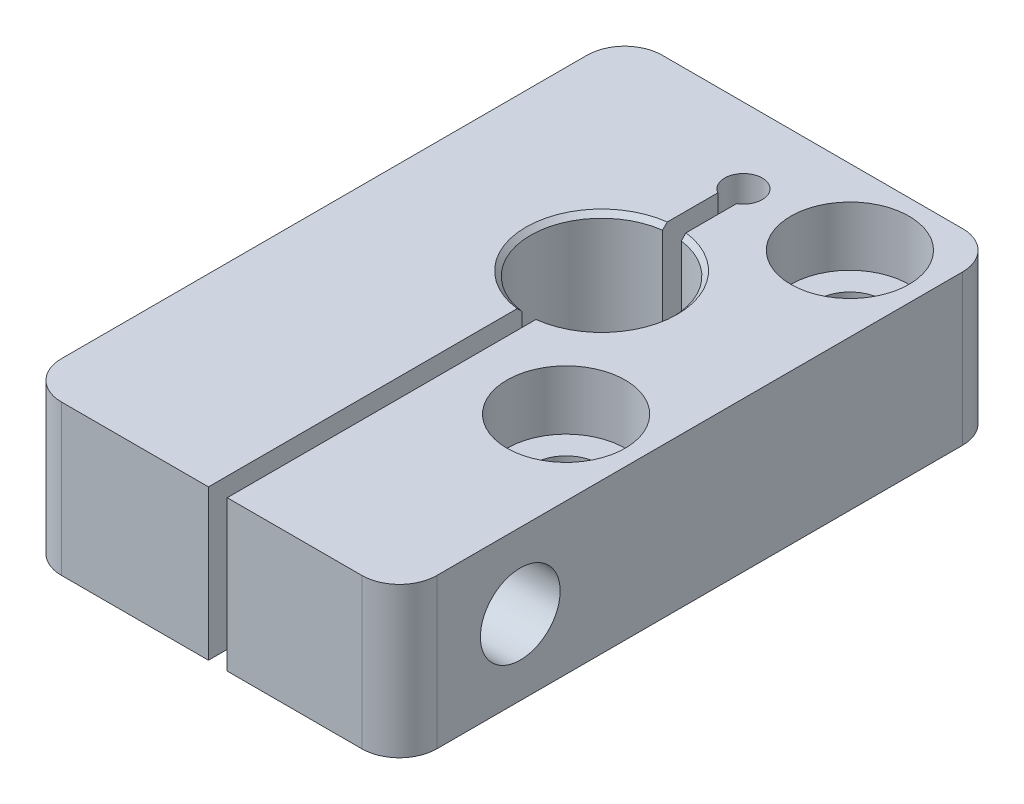
ISO-10303-21;
HEADER;
FILE_DESCRIPTION(('STEP AP214'),'2;1');
FILE_NAME('part.step','',(''),(''),'','','');
FILE_SCHEMA(('AUTOMOTIVE_DESIGN { 1 0 10303 214 1 1 1 1 }'));
ENDSEC;
DATA;
#1=APPLICATION_CONTEXT('core data for automotive mechanical design processes');
#2=APPLICATION_PROTOCOL_DEFINITION('international standard','automotive_design',2000,#1);
#3=PRODUCT_CONTEXT('',#1,'mechanical');
#4=PRODUCT('Part','Part','',(#3));
#5=PRODUCT_RELATED_PRODUCT_CATEGORY('part','',(#4));
#6=PRODUCT_DEFINITION_FORMATION('','',#4);
#7=PRODUCT_DEFINITION_CONTEXT('part definition',#1,'design');
#8=PRODUCT_DEFINITION('design','',#6,#7);
#9=PRODUCT_DEFINITION_SHAPE('','',#8);
#10=(LENGTH_UNIT() NAMED_UNIT(*) SI_UNIT(.MILLI.,.METRE.));
#11=(NAMED_UNIT(*) PLANE_ANGLE_UNIT() SI_UNIT($,.RADIAN.));
#12=(NAMED_UNIT(*) SI_UNIT($,.STERADIAN.) SOLID_ANGLE_UNIT());
#13=UNCERTAINTY_MEASURE_WITH_UNIT(LENGTH_MEASURE(1.E-05),#10,'distance_accuracy_value','');
#14=(GEOMETRIC_REPRESENTATION_CONTEXT(3) GLOBAL_UNCERTAINTY_ASSIGNED_CONTEXT((#13)) GLOBAL_UNIT_ASSIGNED_CONTEXT((#10,
#11,#12)) REPRESENTATION_CONTEXT('',''));
#15=CARTESIAN_POINT('',(0.,0.,0.));
#16=DIRECTION('',(0.,0.,1.));
#17=DIRECTION('',(1.,0.,0.));
#18=AXIS2_PLACEMENT_3D('',#15,#16,#17);
#19=CARTESIAN_POINT('',(15.875,6.35,25.4));
#20=DIRECTION('',(0.,0.,1.));
#21=DIRECTION('',(1.,0.,0.));
#22=AXIS2_PLACEMENT_3D('',#19,#20,#21);
#23=PLANE('',#22);
#24=DIRECTION('',(1.,0.,0.));
#25=VECTOR('',#24,1.);
#26=CARTESIAN_POINT('',(-15.875,-6.35,25.4));
#27=LINE('',#26,#25);
#28=CARTESIAN_POINT('',(1.31875000000001,-6.35,25.4));
#29=VERTEX_POINT('',#28);
#30=CARTESIAN_POINT('',(12.7,-6.35,25.4));
#31=VERTEX_POINT('',#30);
#32=EDGE_CURVE('E257',#29,#31,#27,.T.);
#33=ORIENTED_EDGE('',*,*,#32,.T.);
#34=DIRECTION('',(0.,1.,0.));
#35=VECTOR('',#34,1.);
#36=CARTESIAN_POINT('',(12.7,6.35,25.4));
#37=LINE('',#36,#35);
#38=CARTESIAN_POINT('',(12.7,6.35,25.4));
#39=VERTEX_POINT('',#38);
#40=EDGE_CURVE('E308',#31,#39,#37,.T.);
#41=ORIENTED_EDGE('',*,*,#40,.T.);
#42=DIRECTION('',(-1.,0.,0.));
#43=VECTOR('',#42,1.);
#44=CARTESIAN_POINT('',(-15.875,6.35,25.4));
#45=LINE('',#44,#43);
#46=CARTESIAN_POINT('',(1.31875,6.35,25.4));
#47=VERTEX_POINT('',#46);
#48=EDGE_CURVE('E255',#39,#47,#45,.T.);
#49=ORIENTED_EDGE('',*,*,#48,.T.);
#50=DIRECTION('',(0.,1.,0.));
#51=VECTOR('',#50,1.);
#52=CARTESIAN_POINT('',(1.31875000000001,-6.351,25.4));
#53=LINE('',#52,#51);
#54=EDGE_CURVE('E220',#29,#47,#53,.T.);
#55=ORIENTED_EDGE('',*,*,#54,.F.);
#56=EDGE_LOOP('',(#33,#41,#49,#55));
#57=FACE_BOUND('',#56,.T.);
#58=ADVANCED_FACE('F34',(#57),#23,.T.);
#59=CARTESIAN_POINT('',(-15.875,6.35,25.4));
#60=DIRECTION('',(0.,-1.,0.));
#61=DIRECTION('',(1.,0.,0.));
#62=AXIS2_PLACEMENT_3D('',#59,#60,#61);
#63=PLANE('',#62);
#64=CARTESIAN_POINT('',(9.525,6.35,-19.05));
#65=DIRECTION('',(0.,1.,0.));
#66=DIRECTION('',(0.,0.,1.));
#67=AXIS2_PLACEMENT_3D('',#64,#65,#66);
#68=CIRCLE('',#67,5.);
#69=CARTESIAN_POINT('',(9.525,6.35,-14.05));
#70=VERTEX_POINT('',#69);
#71=EDGE_CURVE('E175',#70,#70,#68,.T.);
#72=ORIENTED_EDGE('',*,*,#71,.F.);
#73=EDGE_LOOP('',(#72));
#74=FACE_BOUND('',#73,.T.);
#75=CARTESIAN_POINT('',(9.525,6.35,4.95));
#76=DIRECTION('',(0.,1.,0.));
#77=DIRECTION('',(0.,0.,1.));
#78=AXIS2_PLACEMENT_3D('',#75,#76,#77);
#79=CIRCLE('',#78,5.);
#80=CARTESIAN_POINT('',(9.525,6.35,9.95));
#81=VERTEX_POINT('',#80);
#82=EDGE_CURVE('E242',#81,#81,#79,.T.);
#83=ORIENTED_EDGE('',*,*,#82,.F.);
#84=EDGE_LOOP('',(#83));
#85=FACE_BOUND('',#84,.T.);
#86=DIRECTION('',(0.,0.,-1.));
#87=VECTOR('',#86,1.);
#88=CARTESIAN_POINT('',(1.31875,6.35,-17.6751846714922));
#89=LINE('',#88,#87);
#90=CARTESIAN_POINT('',(1.31875,6.35,-13.3974381212522));
#91=VERTEX_POINT('',#90);
#92=CARTESIAN_POINT('',(1.31875,6.35,-17.6751846714922));
#93=VERTEX_POINT('',#92);
#94=EDGE_CURVE('E188',#91,#93,#89,.T.);
#95=ORIENTED_EDGE('',*,*,#94,.F.);
#96=CARTESIAN_POINT('',(0.525000000000004,6.35,-7.05));
#97=DIRECTION('',(0.,-1.,0.));
#98=DIRECTION('',(1.,0.,0.));
#99=AXIS2_PLACEMENT_3D('',#96,#97,#98);
#100=CIRCLE('',#99,6.39687500000001);
#101=CARTESIAN_POINT('',(1.31875,6.35,-0.702561878747839));
#102=VERTEX_POINT('',#101);
#103=EDGE_CURVE('E518',#91,#102,#100,.T.);
#104=ORIENTED_EDGE('',*,*,#103,.T.);
#105=DIRECTION('',(0.,0.,-1.));
#106=VECTOR('',#105,1.);
#107=CARTESIAN_POINT('',(1.31875,6.35,-1.10273500359198));
#108=LINE('',#107,#106);
#109=EDGE_CURVE('E209',#47,#102,#108,.T.);
#110=ORIENTED_EDGE('',*,*,#109,.F.);
#111=ORIENTED_EDGE('',*,*,#48,.F.);
#112=CARTESIAN_POINT('',(12.7,6.35,22.225));
#113=DIRECTION('',(0.,-1.,0.));
#114=DIRECTION('',(1.,0.,0.));
#115=AXIS2_PLACEMENT_3D('',#112,#113,#114);
#116=CIRCLE('',#115,3.175);
#117=CARTESIAN_POINT('',(15.875,6.35,22.225));
#118=VERTEX_POINT('',#117);
#119=EDGE_CURVE('E297',#39,#118,#116,.F.);
#120=ORIENTED_EDGE('',*,*,#119,.T.);
#121=DIRECTION('',(0.,0.,-1.));
#122=VECTOR('',#121,1.);
#123=CARTESIAN_POINT('',(15.875,6.35,25.4));
#124=LINE('',#123,#122);
#125=CARTESIAN_POINT('',(15.875,6.35,-22.225));
#126=VERTEX_POINT('',#125);
#127=EDGE_CURVE('E261',#118,#126,#124,.T.);
#128=ORIENTED_EDGE('',*,*,#127,.T.);
#129=CARTESIAN_POINT('',(12.7,6.35,-22.225));
#130=DIRECTION('',(0.,-1.,0.));
#131=DIRECTION('',(1.,0.,0.));
#132=AXIS2_PLACEMENT_3D('',#129,#130,#131);
#133=CIRCLE('',#132,3.175);
#134=CARTESIAN_POINT('',(12.7,6.35,-25.4));
#135=VERTEX_POINT('',#134);
#136=EDGE_CURVE('E299',#126,#135,#133,.F.);
#137=ORIENTED_EDGE('',*,*,#136,.T.);
#138=DIRECTION('',(-1.,0.,0.));
#139=VECTOR('',#138,1.);
#140=CARTESIAN_POINT('',(-15.875,6.35,-25.4));
#141=LINE('',#140,#139);
#142=CARTESIAN_POINT('',(-12.7,6.35,-25.4));
#143=VERTEX_POINT('',#142);
#144=EDGE_CURVE('E254',#135,#143,#141,.T.);
#145=ORIENTED_EDGE('',*,*,#144,.T.);
#146=CARTESIAN_POINT('',(-12.7,6.35,-22.225));
#147=DIRECTION('',(0.,-1.,0.));
#148=DIRECTION('',(1.,0.,0.));
#149=AXIS2_PLACEMENT_3D('',#146,#147,#148);
#150=CIRCLE('',#149,3.175);
#151=CARTESIAN_POINT('',(-15.875,6.35,-22.225));
#152=VERTEX_POINT('',#151);
#153=EDGE_CURVE('E301',#143,#152,#150,.F.);
#154=ORIENTED_EDGE('',*,*,#153,.T.);
#155=DIRECTION('',(0.,0.,-1.));
#156=VECTOR('',#155,1.);
#157=CARTESIAN_POINT('',(-15.875,6.35,25.4));
#158=LINE('',#157,#156);
#159=CARTESIAN_POINT('',(-15.875,6.35,22.225));
#160=VERTEX_POINT('',#159);
#161=EDGE_CURVE('E275',#160,#152,#158,.T.);
#162=ORIENTED_EDGE('',*,*,#161,.F.);
#163=CARTESIAN_POINT('',(-12.7,6.35,22.225));
#164=DIRECTION('',(0.,-1.,0.));
#165=DIRECTION('',(1.,0.,0.));
#166=AXIS2_PLACEMENT_3D('',#163,#164,#165);
#167=CIRCLE('',#166,3.175);
#168=CARTESIAN_POINT('',(-12.7,6.35,25.4));
#169=VERTEX_POINT('',#168);
#170=EDGE_CURVE('E295',#160,#169,#167,.F.);
#171=ORIENTED_EDGE('',*,*,#170,.T.);
#172=CARTESIAN_POINT('',(-0.268749999999995,6.35,25.4));
#173=VERTEX_POINT('',#172);
#174=EDGE_CURVE('E258',#173,#169,#45,.T.);
#175=ORIENTED_EDGE('',*,*,#174,.F.);
#176=DIRECTION('',(0.,0.,1.));
#177=VECTOR('',#176,1.);
#178=CARTESIAN_POINT('',(-0.268749999999996,6.35,-1.10273500359198));
#179=LINE('',#178,#177);
#180=CARTESIAN_POINT('',(-0.268749999999996,6.35,-0.702561878747813));
#181=VERTEX_POINT('',#180);
#182=EDGE_CURVE('E207',#181,#173,#179,.T.);
#183=ORIENTED_EDGE('',*,*,#182,.F.);
#184=CARTESIAN_POINT('',(0.525000000000004,6.35,-7.05));
#185=DIRECTION('',(0.,-1.,0.));
#186=DIRECTION('',(1.,0.,0.));
#187=AXIS2_PLACEMENT_3D('',#184,#185,#186);
#188=CIRCLE('',#187,6.39687500000004);
#189=CARTESIAN_POINT('',(-0.268749999999996,6.35,-13.3974381212522));
#190=VERTEX_POINT('',#189);
#191=EDGE_CURVE('E514',#181,#190,#188,.T.);
#192=ORIENTED_EDGE('',*,*,#191,.T.);
#193=DIRECTION('',(0.,0.,1.));
#194=VECTOR('',#193,1.);
#195=CARTESIAN_POINT('',(-0.268749999999996,6.35,-17.6751846714922));
#196=LINE('',#195,#194);
#197=CARTESIAN_POINT('',(-0.268749999999996,6.35,-17.6751846714922));
#198=VERTEX_POINT('',#197);
#199=EDGE_CURVE('E205',#198,#190,#196,.T.);
#200=ORIENTED_EDGE('',*,*,#199,.F.);
#201=CARTESIAN_POINT('',(0.525000000000004,6.35,-19.05));
#202=DIRECTION('',(0.,1.,0.));
#203=DIRECTION('',(-1.,0.,0.));
#204=AXIS2_PLACEMENT_3D('',#201,#202,#203);
#205=CIRCLE('',#204,1.5875);
#206=EDGE_CURVE('E185',#93,#198,#205,.T.);
#207=ORIENTED_EDGE('',*,*,#206,.F.);
#208=EDGE_LOOP('',(#95,#104,#110,#111,#120,#128,#137,#145,#154,#162,#171,#175,#183,#192,#200,#207));
#209=FACE_BOUND('',#208,.T.);
#210=ADVANCED_FACE('F455',(#74,#85,#209),#63,.F.);
#211=CARTESIAN_POINT('',(-15.875,-6.35,25.4));
#212=DIRECTION('',(1.,0.,0.));
#213=DIRECTION('',(0.,0.,-1.));
#214=AXIS2_PLACEMENT_3D('',#211,#212,#213);
#215=PLANE('',#214);
#216=CARTESIAN_POINT('',(-15.875,0.,15.175));
#217=DIRECTION('',(1.,0.,0.));
#218=DIRECTION('',(0.,0.,-1.));
#219=AXIS2_PLACEMENT_3D('',#216,#217,#218);
#220=CIRCLE('',#219,2.5);
#221=CARTESIAN_POINT('',(-15.875,0.,12.675));
#222=VERTEX_POINT('',#221);
#223=EDGE_CURVE('E557',#222,#222,#220,.T.);
#224=ORIENTED_EDGE('',*,*,#223,.T.);
#225=EDGE_LOOP('',(#224));
#226=FACE_BOUND('',#225,.T.);
#227=ORIENTED_EDGE('',*,*,#161,.T.);
#228=DIRECTION('',(0.,-1.,0.));
#229=VECTOR('',#228,1.);
#230=CARTESIAN_POINT('',(-15.875,-6.35,-22.225));
#231=LINE('',#230,#229);
#232=CARTESIAN_POINT('',(-15.875,-6.35,-22.225));
#233=VERTEX_POINT('',#232);
#234=EDGE_CURVE('E280',#152,#233,#231,.T.);
#235=ORIENTED_EDGE('',*,*,#234,.T.);
#236=DIRECTION('',(0.,0.,-1.));
#237=VECTOR('',#236,1.);
#238=CARTESIAN_POINT('',(-15.875,-6.35,25.4));
#239=LINE('',#238,#237);
#240=CARTESIAN_POINT('',(-15.875,-6.35,22.225));
#241=VERTEX_POINT('',#240);
#242=EDGE_CURVE('E272',#241,#233,#239,.T.);
#243=ORIENTED_EDGE('',*,*,#242,.F.);
#244=DIRECTION('',(0.,-1.,0.));
#245=VECTOR('',#244,1.);
#246=CARTESIAN_POINT('',(-15.875,6.35,22.225));
#247=LINE('',#246,#245);
#248=EDGE_CURVE('E278',#241,#160,#247,.F.);
#249=ORIENTED_EDGE('',*,*,#248,.T.);
#250=EDGE_LOOP('',(#227,#235,#243,#249));
#251=FACE_BOUND('',#250,.T.);
#252=ADVANCED_FACE('F452',(#226,#251),#215,.F.);
#253=CARTESIAN_POINT('',(-15.875,-6.35,25.4));
#254=DIRECTION('',(0.,1.,0.));
#255=DIRECTION('',(-1.,0.,0.));
#256=AXIS2_PLACEMENT_3D('',#253,#254,#255);
#257=PLANE('',#256);
#258=DIRECTION('',(0.,0.,1.));
#259=VECTOR('',#258,1.);
#260=CARTESIAN_POINT('',(1.31875,-6.35,-1.10273500359198));
#261=LINE('',#260,#259);
#262=CARTESIAN_POINT('',(1.31875,-6.35,-0.702561878747806));
#263=VERTEX_POINT('',#262);
#264=EDGE_CURVE('E197',#263,#29,#261,.T.);
#265=ORIENTED_EDGE('',*,*,#264,.F.);
#266=CARTESIAN_POINT('',(0.525000000000005,-6.35,-7.05));
#267=DIRECTION('',(0.,1.,0.));
#268=DIRECTION('',(-1.,0.,0.));
#269=AXIS2_PLACEMENT_3D('',#266,#267,#268);
#270=CIRCLE('',#269,6.39687500000004);
#271=CARTESIAN_POINT('',(1.31875,-6.35,-13.3974381212522));
#272=VERTEX_POINT('',#271);
#273=EDGE_CURVE('E11',#263,#272,#270,.T.);
#274=ORIENTED_EDGE('',*,*,#273,.T.);
#275=DIRECTION('',(0.,0.,1.));
#276=VECTOR('',#275,1.);
#277=CARTESIAN_POINT('',(1.31875,-6.35,-17.6751846714922));
#278=LINE('',#277,#276);
#279=CARTESIAN_POINT('',(1.31875,-6.35,-17.6751846714922));
#280=VERTEX_POINT('',#279);
#281=EDGE_CURVE('E194',#280,#272,#278,.T.);
#282=ORIENTED_EDGE('',*,*,#281,.F.);
#283=CARTESIAN_POINT('',(0.525000000000005,-6.35,-19.05));
#284=DIRECTION('',(0.,1.,0.));
#285=DIRECTION('',(-1.,0.,0.));
#286=AXIS2_PLACEMENT_3D('',#283,#284,#285);
#287=CIRCLE('',#286,1.5875);
#288=CARTESIAN_POINT('',(-0.268749999999995,-6.35,-17.6751846714922));
#289=VERTEX_POINT('',#288);
#290=EDGE_CURVE('E182',#289,#280,#287,.F.);
#291=ORIENTED_EDGE('',*,*,#290,.F.);
#292=DIRECTION('',(0.,0.,-1.));
#293=VECTOR('',#292,1.);
#294=CARTESIAN_POINT('',(-0.268749999999995,-6.35,-17.6751846714922));
#295=LINE('',#294,#293);
#296=CARTESIAN_POINT('',(-0.268749999999995,-6.35,-13.3974381212522));
#297=VERTEX_POINT('',#296);
#298=EDGE_CURVE('E168',#297,#289,#295,.T.);
#299=ORIENTED_EDGE('',*,*,#298,.F.);
#300=CARTESIAN_POINT('',(0.525000000000005,-6.35,-7.05));
#301=DIRECTION('',(0.,1.,0.));
#302=DIRECTION('',(-1.,0.,0.));
#303=AXIS2_PLACEMENT_3D('',#300,#301,#302);
#304=CIRCLE('',#303,6.39687500000003);
#305=CARTESIAN_POINT('',(-0.268749999999995,-6.35,-0.702561878747818));
#306=VERTEX_POINT('',#305);
#307=EDGE_CURVE('E43',#297,#306,#304,.T.);
#308=ORIENTED_EDGE('',*,*,#307,.T.);
#309=DIRECTION('',(0.,0.,-1.));
#310=VECTOR('',#309,1.);
#311=CARTESIAN_POINT('',(-0.268749999999995,-6.35,-1.10273500359198));
#312=LINE('',#311,#310);
#313=CARTESIAN_POINT('',(-0.268749999999995,-6.35,25.4));
#314=VERTEX_POINT('',#313);
#315=EDGE_CURVE('E195',#314,#306,#312,.T.);
#316=ORIENTED_EDGE('',*,*,#315,.F.);
#317=CARTESIAN_POINT('',(-12.7,-6.35,25.4));
#318=VERTEX_POINT('',#317);
#319=EDGE_CURVE('E259',#318,#314,#27,.T.);
#320=ORIENTED_EDGE('',*,*,#319,.F.);
#321=CARTESIAN_POINT('',(-12.7,-6.35,22.225));
#322=DIRECTION('',(0.,1.,0.));
#323=DIRECTION('',(-1.,0.,0.));
#324=AXIS2_PLACEMENT_3D('',#321,#322,#323);
#325=CIRCLE('',#324,3.175);
#326=EDGE_CURVE('E283',#318,#241,#325,.F.);
#327=ORIENTED_EDGE('',*,*,#326,.T.);
#328=ORIENTED_EDGE('',*,*,#242,.T.);
#329=CARTESIAN_POINT('',(-12.7,-6.35,-22.225));
#330=DIRECTION('',(0.,1.,0.));
#331=DIRECTION('',(-1.,0.,0.));
#332=AXIS2_PLACEMENT_3D('',#329,#330,#331);
#333=CIRCLE('',#332,3.175);
#334=CARTESIAN_POINT('',(-12.7,-6.35,-25.4));
#335=VERTEX_POINT('',#334);
#336=EDGE_CURVE('E289',#233,#335,#333,.F.);
#337=ORIENTED_EDGE('',*,*,#336,.T.);
#338=DIRECTION('',(1.,0.,0.));
#339=VECTOR('',#338,1.);
#340=CARTESIAN_POINT('',(-15.875,-6.35,-25.4));
#341=LINE('',#340,#339);
#342=CARTESIAN_POINT('',(12.7,-6.35,-25.4));
#343=VERTEX_POINT('',#342);
#344=EDGE_CURVE('E264',#335,#343,#341,.T.);
#345=ORIENTED_EDGE('',*,*,#344,.T.);
#346=CARTESIAN_POINT('',(12.7,-6.35,-22.225));
#347=DIRECTION('',(0.,1.,0.));
#348=DIRECTION('',(-1.,0.,0.));
#349=AXIS2_PLACEMENT_3D('',#346,#347,#348);
#350=CIRCLE('',#349,3.175);
#351=CARTESIAN_POINT('',(15.875,-6.35,-22.225));
#352=VERTEX_POINT('',#351);
#353=EDGE_CURVE('E287',#343,#352,#350,.F.);
#354=ORIENTED_EDGE('',*,*,#353,.T.);
#355=DIRECTION('',(0.,0.,-1.));
#356=VECTOR('',#355,1.);
#357=CARTESIAN_POINT('',(15.875,-6.35,25.4));
#358=LINE('',#357,#356);
#359=CARTESIAN_POINT('',(15.875,-6.35,22.225));
#360=VERTEX_POINT('',#359);
#361=EDGE_CURVE('E269',#360,#352,#358,.T.);
#362=ORIENTED_EDGE('',*,*,#361,.F.);
#363=CARTESIAN_POINT('',(12.7,-6.35,22.225));
#364=DIRECTION('',(0.,1.,0.));
#365=DIRECTION('',(-1.,0.,0.));
#366=AXIS2_PLACEMENT_3D('',#363,#364,#365);
#367=CIRCLE('',#366,3.175);
#368=EDGE_CURVE('E285',#360,#31,#367,.F.);
#369=ORIENTED_EDGE('',*,*,#368,.T.);
#370=ORIENTED_EDGE('',*,*,#32,.F.);
#371=EDGE_LOOP('',(#265,#274,#282,#291,#299,#308,#316,#320,#327,#328,#337,#345,#354,#362,#369,#370));
#372=FACE_BOUND('',#371,.T.);
#373=CARTESIAN_POINT('',(9.525,-6.35,-19.05));
#374=DIRECTION('',(0.,1.,0.));
#375=DIRECTION('',(-1.,0.,0.));
#376=AXIS2_PLACEMENT_3D('',#373,#374,#375);
#377=CIRCLE('',#376,2.75);
#378=CARTESIAN_POINT('',(6.77500000000001,-6.35,-19.05));
#379=VERTEX_POINT('',#378);
#380=EDGE_CURVE('E239',#379,#379,#377,.T.);
#381=ORIENTED_EDGE('',*,*,#380,.T.);
#382=EDGE_LOOP('',(#381));
#383=FACE_BOUND('',#382,.T.);
#384=CARTESIAN_POINT('',(9.525,-6.35,4.95));
#385=DIRECTION('',(0.,1.,0.));
#386=DIRECTION('',(-1.,0.,0.));
#387=AXIS2_PLACEMENT_3D('',#384,#385,#386);
#388=CIRCLE('',#387,2.75);
#389=CARTESIAN_POINT('',(6.77500000000001,-6.35,4.95));
#390=VERTEX_POINT('',#389);
#391=EDGE_CURVE('E251',#390,#390,#388,.T.);
#392=ORIENTED_EDGE('',*,*,#391,.T.);
#393=EDGE_LOOP('',(#392));
#394=FACE_BOUND('',#393,.T.);
#395=ADVANCED_FACE('F191',(#372,#383,#394),#257,.F.);
#396=CARTESIAN_POINT('',(15.875,-6.35,25.4));
#397=DIRECTION('',(-1.,0.,0.));
#398=DIRECTION('',(0.,0.,1.));
#399=AXIS2_PLACEMENT_3D('',#396,#397,#398);
#400=PLANE('',#399);
#401=CARTESIAN_POINT('',(15.875,0.,15.175));
#402=DIRECTION('',(1.,0.,0.));
#403=DIRECTION('',(0.,0.,-1.));
#404=AXIS2_PLACEMENT_3D('',#401,#402,#403);
#405=CIRCLE('',#404,3.373501);
#406=CARTESIAN_POINT('',(15.875,0.,11.801499));
#407=VERTEX_POINT('',#406);
#408=EDGE_CURVE('E560',#407,#407,#405,.T.);
#409=ORIENTED_EDGE('',*,*,#408,.F.);
#410=EDGE_LOOP('',(#409));
#411=FACE_BOUND('',#410,.T.);
#412=ORIENTED_EDGE('',*,*,#361,.T.);
#413=DIRECTION('',(0.,1.,0.));
#414=VECTOR('',#413,1.);
#415=CARTESIAN_POINT('',(15.875,-6.35,-22.225));
#416=LINE('',#415,#414);
#417=EDGE_CURVE('E305',#352,#126,#416,.T.);
#418=ORIENTED_EDGE('',*,*,#417,.T.);
#419=ORIENTED_EDGE('',*,*,#127,.F.);
#420=DIRECTION('',(0.,1.,0.));
#421=VECTOR('',#420,1.);
#422=CARTESIAN_POINT('',(15.875,-6.35,22.225));
#423=LINE('',#422,#421);
#424=EDGE_CURVE('E303',#118,#360,#423,.F.);
#425=ORIENTED_EDGE('',*,*,#424,.T.);
#426=EDGE_LOOP('',(#412,#418,#419,#425));
#427=FACE_BOUND('',#426,.T.);
#428=ADVANCED_FACE('F442',(#411,#427),#400,.F.);
#429=ORIENTED_EDGE('',*,*,#174,.T.);
#430=DIRECTION('',(0.,-1.,0.));
#431=VECTOR('',#430,1.);
#432=CARTESIAN_POINT('',(-12.7,-6.35,25.4));
#433=LINE('',#432,#431);
#434=EDGE_CURVE('E311',#169,#318,#433,.T.);
#435=ORIENTED_EDGE('',*,*,#434,.T.);
#436=ORIENTED_EDGE('',*,*,#319,.T.);
#437=DIRECTION('',(0.,1.,0.));
#438=VECTOR('',#437,1.);
#439=CARTESIAN_POINT('',(-0.268749999999995,-6.351,25.4));
#440=LINE('',#439,#438);
#441=EDGE_CURVE('E223',#314,#173,#440,.T.);
#442=ORIENTED_EDGE('',*,*,#441,.T.);
#443=EDGE_LOOP('',(#429,#435,#436,#442));
#444=FACE_BOUND('',#443,.T.);
#445=ADVANCED_FACE('F439',(#444),#23,.T.);
#446=CARTESIAN_POINT('',(15.875,6.35,-25.4));
#447=DIRECTION('',(0.,0.,1.));
#448=DIRECTION('',(1.,0.,0.));
#449=AXIS2_PLACEMENT_3D('',#446,#447,#448);
#450=PLANE('',#449);
#451=ORIENTED_EDGE('',*,*,#344,.F.);
#452=DIRECTION('',(0.,-1.,0.));
#453=VECTOR('',#452,1.);
#454=CARTESIAN_POINT('',(-12.7,6.35,-25.4));
#455=LINE('',#454,#453);
#456=EDGE_CURVE('E293',#335,#143,#455,.F.);
#457=ORIENTED_EDGE('',*,*,#456,.T.);
#458=ORIENTED_EDGE('',*,*,#144,.F.);
#459=DIRECTION('',(0.,1.,0.));
#460=VECTOR('',#459,1.);
#461=CARTESIAN_POINT('',(12.7,6.35,-25.4));
#462=LINE('',#461,#460);
#463=EDGE_CURVE('E291',#135,#343,#462,.F.);
#464=ORIENTED_EDGE('',*,*,#463,.T.);
#465=EDGE_LOOP('',(#451,#457,#458,#464));
#466=FACE_BOUND('',#465,.T.);
#467=ADVANCED_FACE('F437',(#466),#450,.F.);
#468=CARTESIAN_POINT('',(9.525,6.35,4.95));
#469=DIRECTION('',(0.,1.,0.));
#470=DIRECTION('',(0.,0.,1.));
#471=AXIS2_PLACEMENT_3D('',#468,#469,#470);
#472=CYLINDRICAL_SURFACE('',#471,2.75);
#473=ORIENTED_EDGE('',*,*,#391,.F.);
#474=EDGE_LOOP('',(#473));
#475=FACE_BOUND('',#474,.T.);
#476=CARTESIAN_POINT('',(9.525,1.35,4.95));
#477=DIRECTION('',(0.,1.,0.));
#478=DIRECTION('',(0.,0.,1.));
#479=AXIS2_PLACEMENT_3D('',#476,#477,#478);
#480=CIRCLE('',#479,2.75);
#481=CARTESIAN_POINT('',(9.525,1.35,7.7));
#482=VERTEX_POINT('',#481);
#483=EDGE_CURVE('E248',#482,#482,#480,.T.);
#484=ORIENTED_EDGE('',*,*,#483,.T.);
#485=EDGE_LOOP('',(#484));
#486=FACE_BOUND('',#485,.T.);
#487=ADVANCED_FACE('F433',(#475,#486),#472,.F.);
#488=CARTESIAN_POINT('',(12.275,1.35,4.95));
#489=DIRECTION('',(0.,-1.,0.));
#490=DIRECTION('',(0.,0.,-1.));
#491=AXIS2_PLACEMENT_3D('',#488,#489,#490);
#492=PLANE('',#491);
#493=ORIENTED_EDGE('',*,*,#483,.F.);
#494=EDGE_LOOP('',(#493));
#495=FACE_BOUND('',#494,.T.);
#496=CARTESIAN_POINT('',(9.525,1.35,4.95));
#497=DIRECTION('',(0.,1.,0.));
#498=DIRECTION('',(0.,0.,1.));
#499=AXIS2_PLACEMENT_3D('',#496,#497,#498);
#500=CIRCLE('',#499,5.);
#501=CARTESIAN_POINT('',(9.525,1.35,9.95));
#502=VERTEX_POINT('',#501);
#503=EDGE_CURVE('E245',#502,#502,#500,.T.);
#504=ORIENTED_EDGE('',*,*,#503,.T.);
#505=EDGE_LOOP('',(#504));
#506=FACE_BOUND('',#505,.T.);
#507=ADVANCED_FACE('F429',(#495,#506),#492,.F.);
#508=CARTESIAN_POINT('',(9.525,6.35,4.95));
#509=DIRECTION('',(0.,1.,0.));
#510=DIRECTION('',(0.,0.,1.));
#511=AXIS2_PLACEMENT_3D('',#508,#509,#510);
#512=CYLINDRICAL_SURFACE('',#511,5.);
#513=ORIENTED_EDGE('',*,*,#503,.F.);
#514=EDGE_LOOP('',(#513));
#515=FACE_BOUND('',#514,.T.);
#516=ORIENTED_EDGE('',*,*,#82,.T.);
#517=EDGE_LOOP('',(#516));
#518=FACE_BOUND('',#517,.T.);
#519=ADVANCED_FACE('F425',(#515,#518),#512,.F.);
#520=CARTESIAN_POINT('',(9.525,6.35,-19.05));
#521=DIRECTION('',(0.,1.,0.));
#522=DIRECTION('',(0.,0.,1.));
#523=AXIS2_PLACEMENT_3D('',#520,#521,#522);
#524=CYLINDRICAL_SURFACE('',#523,2.75);
#525=ORIENTED_EDGE('',*,*,#380,.F.);
#526=EDGE_LOOP('',(#525));
#527=FACE_BOUND('',#526,.T.);
#528=CARTESIAN_POINT('',(9.525,1.35,-19.05));
#529=DIRECTION('',(0.,1.,0.));
#530=DIRECTION('',(0.,0.,1.));
#531=AXIS2_PLACEMENT_3D('',#528,#529,#530);
#532=CIRCLE('',#531,2.75);
#533=CARTESIAN_POINT('',(9.525,1.35,-16.3));
#534=VERTEX_POINT('',#533);
#535=EDGE_CURVE('E236',#534,#534,#532,.T.);
#536=ORIENTED_EDGE('',*,*,#535,.T.);
#537=EDGE_LOOP('',(#536));
#538=FACE_BOUND('',#537,.T.);
#539=ADVANCED_FACE('F421',(#527,#538),#524,.F.);
#540=CARTESIAN_POINT('',(12.275,1.35,-19.05));
#541=DIRECTION('',(0.,-1.,0.));
#542=DIRECTION('',(0.,0.,-1.));
#543=AXIS2_PLACEMENT_3D('',#540,#541,#542);
#544=PLANE('',#543);
#545=ORIENTED_EDGE('',*,*,#535,.F.);
#546=EDGE_LOOP('',(#545));
#547=FACE_BOUND('',#546,.T.);
#548=CARTESIAN_POINT('',(9.525,1.35,-19.05));
#549=DIRECTION('',(0.,1.,0.));
#550=DIRECTION('',(0.,0.,1.));
#551=AXIS2_PLACEMENT_3D('',#548,#549,#550);
#552=CIRCLE('',#551,5.);
#553=CARTESIAN_POINT('',(9.525,1.35,-14.05));
#554=VERTEX_POINT('',#553);
#555=EDGE_CURVE('E233',#554,#554,#552,.T.);
#556=ORIENTED_EDGE('',*,*,#555,.T.);
#557=EDGE_LOOP('',(#556));
#558=FACE_BOUND('',#557,.T.);
#559=ADVANCED_FACE('F417',(#547,#558),#544,.F.);
#560=CARTESIAN_POINT('',(9.525,6.35,-19.05));
#561=DIRECTION('',(0.,1.,0.));
#562=DIRECTION('',(0.,0.,1.));
#563=AXIS2_PLACEMENT_3D('',#560,#561,#562);
#564=CYLINDRICAL_SURFACE('',#563,5.);
#565=ORIENTED_EDGE('',*,*,#555,.F.);
#566=EDGE_LOOP('',(#565));
#567=FACE_BOUND('',#566,.T.);
#568=ORIENTED_EDGE('',*,*,#71,.T.);
#569=EDGE_LOOP('',(#568));
#570=FACE_BOUND('',#569,.T.);
#571=ADVANCED_FACE('F414',(#567,#570),#564,.F.);
#572=CARTESIAN_POINT('',(0.525000000000005,-6.351,-19.05));
#573=DIRECTION('',(0.,1.,0.));
#574=DIRECTION('',(-1.,0.,0.));
#575=AXIS2_PLACEMENT_3D('',#572,#573,#574);
#576=CYLINDRICAL_SURFACE('',#575,1.5875);
#577=ORIENTED_EDGE('',*,*,#290,.T.);
#578=DIRECTION('',(0.,1.,0.));
#579=VECTOR('',#578,1.);
#580=CARTESIAN_POINT('',(1.31875,-6.351,-17.6751846714922));
#581=LINE('',#580,#579);
#582=EDGE_CURVE('E176',#280,#93,#581,.T.);
#583=ORIENTED_EDGE('',*,*,#582,.T.);
#584=ORIENTED_EDGE('',*,*,#206,.T.);
#585=DIRECTION('',(0.,1.,0.));
#586=VECTOR('',#585,1.);
#587=CARTESIAN_POINT('',(-0.268749999999995,-6.351,-17.6751846714922));
#588=LINE('',#587,#586);
#589=EDGE_CURVE('E172',#289,#198,#588,.T.);
#590=ORIENTED_EDGE('',*,*,#589,.F.);
#591=EDGE_LOOP('',(#577,#583,#584,#590));
#592=FACE_BOUND('',#591,.T.);
#593=ADVANCED_FACE('F180',(#592),#576,.F.);
#594=CARTESIAN_POINT('',(1.31875,-6.351,-17.6751846714922));
#595=DIRECTION('',(1.,0.,0.));
#596=DIRECTION('',(0.,1.,0.));
#597=AXIS2_PLACEMENT_3D('',#594,#595,#596);
#598=PLANE('',#597);
#599=DIRECTION('',(0.,1.,0.));
#600=VECTOR('',#599,1.);
#601=CARTESIAN_POINT('',(1.31875,-6.351,-12.997264996408));
#602=LINE('',#601,#600);
#603=CARTESIAN_POINT('',(1.31875,-5.95312499999996,-12.997264996408));
#604=VERTEX_POINT('',#603);
#605=CARTESIAN_POINT('',(1.31875,5.95312499999999,-12.997264996408));
#606=VERTEX_POINT('',#605);
#607=EDGE_CURVE('E214',#604,#606,#602,.T.);
#608=ORIENTED_EDGE('',*,*,#607,.T.);
#609=CARTESIAN_POINT('',(1.31875,5.95312499999999,-12.997264996408));
#610=CARTESIAN_POINT('',(1.31875,6.01925301625187,-13.0639781875285));
#611=CARTESIAN_POINT('',(1.31875,6.08538994106337,-13.1306825435115));
#612=CARTESIAN_POINT('',(1.31875,6.21768160773006,-13.2640735851262));
#613=CARTESIAN_POINT('',(1.31875,6.28383634958523,-13.330760270758));
#614=CARTESIAN_POINT('',(1.31875,6.35,-13.3974381212522));
#615=B_SPLINE_CURVE_WITH_KNOTS('',3,(#609,#610,#611,#612,#613,#614),.UNSPECIFIED.,.F.,.F.,(4,2,
4),(0.,0.281801482209814,0.563602964097715),.UNSPECIFIED.);
#616=EDGE_CURVE('E327',#606,#91,#615,.T.);
#617=ORIENTED_EDGE('',*,*,#616,.T.);
#618=ORIENTED_EDGE('',*,*,#94,.T.);
#619=ORIENTED_EDGE('',*,*,#582,.F.);
#620=ORIENTED_EDGE('',*,*,#281,.T.);
#621=CARTESIAN_POINT('',(1.31875,-6.35,-13.3974381212522));
#622=CARTESIAN_POINT('',(1.31875,-6.28383634958523,-13.330760270758));
#623=CARTESIAN_POINT('',(1.31875,-6.21768160773005,-13.2640735851262));
#624=CARTESIAN_POINT('',(1.31875,-6.08538994106335,-13.1306825435115));
#625=CARTESIAN_POINT('',(1.31875,-6.01925301625185,-13.0639781875285));
#626=CARTESIAN_POINT('',(1.31875,-5.95312499999996,-12.997264996408));
#627=B_SPLINE_CURVE_WITH_KNOTS('',3,(#621,#622,#623,#624,#625,#626),.UNSPECIFIED.,.F.,.F.,(4,2,
4),(0.,0.281801481887922,0.56360296409776),.UNSPECIFIED.);
#628=EDGE_CURVE('E320',#272,#604,#627,.T.);
#629=ORIENTED_EDGE('',*,*,#628,.T.);
#630=EDGE_LOOP('',(#608,#617,#618,#619,#620,#629));
#631=FACE_BOUND('',#630,.T.);
#632=ADVANCED_FACE('F337',(#631),#598,.F.);
#633=CARTESIAN_POINT('',(0.525000000000005,-6.351,-7.05));
#634=DIRECTION('',(0.,1.,0.));
#635=DIRECTION('',(-1.,0.,0.));
#636=AXIS2_PLACEMENT_3D('',#633,#634,#635);
#637=CYLINDRICAL_SURFACE('',#636,6.);
#638=DIRECTION('',(0.,1.,0.));
#639=VECTOR('',#638,1.);
#640=CARTESIAN_POINT('',(1.31875,-6.351,-1.10273500359198));
#641=LINE('',#640,#639);
#642=CARTESIAN_POINT('',(1.31875,-5.95312499999996,-1.10273500359198));
#643=VERTEX_POINT('',#642);
#644=CARTESIAN_POINT('',(1.31875,5.95312499999999,-1.10273500359198));
#645=VERTEX_POINT('',#644);
#646=EDGE_CURVE('E217',#643,#645,#641,.T.);
#647=ORIENTED_EDGE('',*,*,#646,.T.);
#648=CARTESIAN_POINT('',(0.525000000000004,5.95312499999999,-7.05));
#649=DIRECTION('',(0.,-1.,0.));
#650=DIRECTION('',(1.,0.,0.));
#651=AXIS2_PLACEMENT_3D('',#648,#649,#650);
#652=CIRCLE('',#651,6.);
#653=EDGE_CURVE('E317',#645,#606,#652,.F.);
#654=ORIENTED_EDGE('',*,*,#653,.T.);
#655=ORIENTED_EDGE('',*,*,#607,.F.);
#656=CARTESIAN_POINT('',(0.525000000000005,-5.95312499999996,-7.05));
#657=DIRECTION('',(0.,1.,0.));
#658=DIRECTION('',(0.,0.,1.));
#659=AXIS2_PLACEMENT_3D('',#656,#657,#658);
#660=CIRCLE('',#659,6.);
#661=EDGE_CURVE('E314',#604,#643,#660,.F.);
#662=ORIENTED_EDGE('',*,*,#661,.T.);
#663=EDGE_LOOP('',(#647,#654,#655,#662));
#664=FACE_BOUND('',#663,.T.);
#665=ADVANCED_FACE('F342',(#664),#637,.F.);
#666=CARTESIAN_POINT('',(1.31875,-6.351,-1.10273500359198));
#667=DIRECTION('',(1.,0.,0.));
#668=DIRECTION('',(0.,1.,0.));
#669=AXIS2_PLACEMENT_3D('',#666,#667,#668);
#670=PLANE('',#669);
#671=CARTESIAN_POINT('',(1.31875000000001,0.,15.175));
#672=DIRECTION('',(1.,0.,0.));
#673=DIRECTION('',(0.,1.,0.));
#674=AXIS2_PLACEMENT_3D('',#671,#672,#673);
#675=CIRCLE('',#674,3.373501);
#676=CARTESIAN_POINT('',(1.31875000000001,3.373501,15.175));
#677=VERTEX_POINT('',#676);
#678=EDGE_CURVE('E199',#677,#677,#675,.T.);
#679=ORIENTED_EDGE('',*,*,#678,.T.);
#680=EDGE_LOOP('',(#679));
#681=FACE_BOUND('',#680,.T.);
#682=ORIENTED_EDGE('',*,*,#109,.T.);
#683=CARTESIAN_POINT('',(1.31875,6.35,-0.702561878747839));
#684=CARTESIAN_POINT('',(1.31875,6.28383634958523,-0.76923972924204));
#685=CARTESIAN_POINT('',(1.31875,6.21768160773006,-0.835926414873767));
#686=CARTESIAN_POINT('',(1.31875,6.08538994106337,-0.969317456488462));
#687=CARTESIAN_POINT('',(1.31875,6.01925301625187,-1.03602181247145));
#688=CARTESIAN_POINT('',(1.31875,5.95312499999999,-1.10273500359198));
#689=B_SPLINE_CURVE_WITH_KNOTS('',3,(#683,#684,#685,#686,#687,#688),.UNSPECIFIED.,.F.,.F.,(4,2,
4),(0.,0.2818014818879,0.563602964097714),.UNSPECIFIED.);
#690=EDGE_CURVE('E367',#102,#645,#689,.T.);
#691=ORIENTED_EDGE('',*,*,#690,.T.);
#692=ORIENTED_EDGE('',*,*,#646,.F.);
#693=CARTESIAN_POINT('',(1.31875,-5.95312499999996,-1.10273500359198));
#694=CARTESIAN_POINT('',(1.31875,-6.01925301625185,-1.03602181247144));
#695=CARTESIAN_POINT('',(1.31875,-6.08538994106335,-0.969317456488451));
#696=CARTESIAN_POINT('',(1.31875,-6.21768160773005,-0.835926414873746));
#697=CARTESIAN_POINT('',(1.31875,-6.28383634958523,-0.769239729242013));
#698=CARTESIAN_POINT('',(1.31875,-6.35,-0.702561878747807));
#699=B_SPLINE_CURVE_WITH_KNOTS('',3,(#693,#694,#695,#696,#697,#698),.UNSPECIFIED.,.F.,.F.,(4,2,
4),(0.,0.281801482209837,0.563602964097759),.UNSPECIFIED.);
#700=EDGE_CURVE('E360',#643,#263,#699,.T.);
#701=ORIENTED_EDGE('',*,*,#700,.T.);
#702=ORIENTED_EDGE('',*,*,#264,.T.);
#703=ORIENTED_EDGE('',*,*,#54,.T.);
#704=EDGE_LOOP('',(#682,#691,#692,#701,#702,#703));
#705=FACE_BOUND('',#704,.T.);
#706=ADVANCED_FACE('F349',(#681,#705),#670,.F.);
#707=CARTESIAN_POINT('',(-0.268749999999995,-6.351,-1.10273500359198));
#708=DIRECTION('',(-1.,0.,0.));
#709=DIRECTION('',(0.,-1.,0.));
#710=AXIS2_PLACEMENT_3D('',#707,#708,#709);
#711=PLANE('',#710);
#712=CARTESIAN_POINT('',(-0.268749999999996,0.,15.175));
#713=DIRECTION('',(1.,0.,0.));
#714=DIRECTION('',(0.,0.,-1.));
#715=AXIS2_PLACEMENT_3D('',#712,#713,#714);
#716=CIRCLE('',#715,2.5);
#717=CARTESIAN_POINT('',(-0.268749999999996,0.,12.675));
#718=VERTEX_POINT('',#717);
#719=EDGE_CURVE('E555',#718,#718,#716,.T.);
#720=ORIENTED_EDGE('',*,*,#719,.F.);
#721=EDGE_LOOP('',(#720));
#722=FACE_BOUND('',#721,.T.);
#723=DIRECTION('',(0.,1.,0.));
#724=VECTOR('',#723,1.);
#725=CARTESIAN_POINT('',(-0.268749999999993,-6.351,-1.10273500359198));
#726=LINE('',#725,#724);
#727=CARTESIAN_POINT('',(-0.268749999999994,-5.95312499999998,-1.10273500359198));
#728=VERTEX_POINT('',#727);
#729=CARTESIAN_POINT('',(-0.268749999999995,5.95312499999997,-1.10273500359198));
#730=VERTEX_POINT('',#729);
#731=EDGE_CURVE('E226',#728,#730,#726,.T.);
#732=ORIENTED_EDGE('',*,*,#731,.T.);
#733=CARTESIAN_POINT('',(-0.268749999999995,5.95312499999997,-1.10273500359198));
#734=CARTESIAN_POINT('',(-0.268749999999995,6.01925301625186,-1.03602181247145));
#735=CARTESIAN_POINT('',(-0.268749999999996,6.08538994106336,-0.969317456488453));
#736=CARTESIAN_POINT('',(-0.268749999999996,6.21768160773006,-0.83592641487375));
#737=CARTESIAN_POINT('',(-0.268749999999996,6.28383634958523,-0.769239729242018));
#738=CARTESIAN_POINT('',(-0.268749999999996,6.35,-0.702561878747813));
#739=B_SPLINE_CURVE_WITH_KNOTS('',3,(#733,#734,#735,#736,#737,#738),.UNSPECIFIED.,.F.,.F.,(4,2,
4),(0.,0.281801482209829,0.563602964097745),.UNSPECIFIED.);
#740=EDGE_CURVE('E389',#730,#181,#739,.T.);
#741=ORIENTED_EDGE('',*,*,#740,.T.);
#742=ORIENTED_EDGE('',*,*,#182,.T.);
#743=ORIENTED_EDGE('',*,*,#441,.F.);
#744=ORIENTED_EDGE('',*,*,#315,.T.);
#745=CARTESIAN_POINT('',(-0.268749999999995,-6.35,-0.702561878747818));
#746=CARTESIAN_POINT('',(-0.268749999999995,-6.28383634958523,-0.769239729242022));
#747=CARTESIAN_POINT('',(-0.268749999999995,-6.21768160773006,-0.835926414873753));
#748=CARTESIAN_POINT('',(-0.268749999999995,-6.08538994106337,-0.969317456488455));
#749=CARTESIAN_POINT('',(-0.268749999999995,-6.01925301625186,-1.03602181247145));
#750=CARTESIAN_POINT('',(-0.268749999999995,-5.95312499999998,-1.10273500359198));
#751=B_SPLINE_CURVE_WITH_KNOTS('',3,(#745,#746,#747,#748,#749,#750),.UNSPECIFIED.,.F.,.F.,(4,2,
4),(0.,0.281801481887913,0.563602964097739),.UNSPECIFIED.);
#752=EDGE_CURVE('E537',#306,#728,#751,.T.);
#753=ORIENTED_EDGE('',*,*,#752,.T.);
#754=EDGE_LOOP('',(#732,#741,#742,#743,#744,#753));
#755=FACE_BOUND('',#754,.T.);
#756=ADVANCED_FACE('F354',(#722,#755),#711,.F.);
#757=CARTESIAN_POINT('',(0.525000000000005,-6.351,-7.05));
#758=DIRECTION('',(0.,1.,0.));
#759=DIRECTION('',(-1.,0.,0.));
#760=AXIS2_PLACEMENT_3D('',#757,#758,#759);
#761=CYLINDRICAL_SURFACE('',#760,6.);
#762=DIRECTION('',(0.,1.,0.));
#763=VECTOR('',#762,1.);
#764=CARTESIAN_POINT('',(-0.268749999999995,-6.351,-12.997264996408));
#765=LINE('',#764,#763);
#766=CARTESIAN_POINT('',(-0.268749999999995,-5.95312499999998,-12.997264996408));
#767=VERTEX_POINT('',#766);
#768=CARTESIAN_POINT('',(-0.268749999999996,5.95312499999997,-12.997264996408));
#769=VERTEX_POINT('',#768);
#770=EDGE_CURVE('E187',#767,#769,#765,.T.);
#771=ORIENTED_EDGE('',*,*,#770,.T.);
#772=CARTESIAN_POINT('',(0.525000000000004,5.95312499999997,-7.05));
#773=DIRECTION('',(0.,-1.,0.));
#774=DIRECTION('',(1.,0.,0.));
#775=AXIS2_PLACEMENT_3D('',#772,#773,#774);
#776=CIRCLE('',#775,6.);
#777=EDGE_CURVE('E540',#769,#730,#776,.F.);
#778=ORIENTED_EDGE('',*,*,#777,.T.);
#779=ORIENTED_EDGE('',*,*,#731,.F.);
#780=CARTESIAN_POINT('',(0.525000000000005,-5.95312499999998,-7.05));
#781=DIRECTION('',(0.,1.,0.));
#782=DIRECTION('',(0.,0.,1.));
#783=AXIS2_PLACEMENT_3D('',#780,#781,#782);
#784=CIRCLE('',#783,6.);
#785=EDGE_CURVE('E373',#728,#767,#784,.F.);
#786=ORIENTED_EDGE('',*,*,#785,.T.);
#787=EDGE_LOOP('',(#771,#778,#779,#786));
#788=FACE_BOUND('',#787,.T.);
#789=ADVANCED_FACE('F410',(#788),#761,.F.);
#790=CARTESIAN_POINT('',(-0.268749999999995,-6.351,-17.6751846714922));
#791=DIRECTION('',(-1.,0.,0.));
#792=DIRECTION('',(0.,-1.,0.));
#793=AXIS2_PLACEMENT_3D('',#790,#791,#792);
#794=PLANE('',#793);
#795=ORIENTED_EDGE('',*,*,#199,.T.);
#796=CARTESIAN_POINT('',(-0.268749999999996,6.35,-13.3974381212522));
#797=CARTESIAN_POINT('',(-0.268749999999996,6.28383634958523,-13.330760270758));
#798=CARTESIAN_POINT('',(-0.268749999999996,6.21768160773006,-13.2640735851262));
#799=CARTESIAN_POINT('',(-0.268749999999996,6.08538994106336,-13.1306825435115));
#800=CARTESIAN_POINT('',(-0.268749999999996,6.01925301625186,-13.0639781875285));
#801=CARTESIAN_POINT('',(-0.268749999999996,5.95312499999997,-12.997264996408));
#802=B_SPLINE_CURVE_WITH_KNOTS('',3,(#796,#797,#798,#799,#800,#801),.UNSPECIFIED.,.F.,.F.,(4,2,
4),(0.,0.281801481887916,0.563602964097746),.UNSPECIFIED.);
#803=EDGE_CURVE('E397',#190,#769,#802,.T.);
#804=ORIENTED_EDGE('',*,*,#803,.T.);
#805=ORIENTED_EDGE('',*,*,#770,.F.);
#806=CARTESIAN_POINT('',(-0.268749999999995,-5.95312499999998,-12.997264996408));
#807=CARTESIAN_POINT('',(-0.268749999999995,-6.01925301625186,-13.0639781875285));
#808=CARTESIAN_POINT('',(-0.268749999999995,-6.08538994106337,-13.1306825435115));
#809=CARTESIAN_POINT('',(-0.268749999999995,-6.21768160773006,-13.2640735851262));
#810=CARTESIAN_POINT('',(-0.268749999999995,-6.28383634958523,-13.330760270758));
#811=CARTESIAN_POINT('',(-0.268749999999995,-6.35,-13.3974381212522));
#812=B_SPLINE_CURVE_WITH_KNOTS('',3,(#806,#807,#808,#809,#810,#811),.UNSPECIFIED.,.F.,.F.,(4,2,
4),(0.,0.281801482209826,0.563602964097738),.UNSPECIFIED.);
#813=EDGE_CURVE('E50',#767,#297,#812,.T.);
#814=ORIENTED_EDGE('',*,*,#813,.T.);
#815=ORIENTED_EDGE('',*,*,#298,.T.);
#816=ORIENTED_EDGE('',*,*,#589,.T.);
#817=EDGE_LOOP('',(#795,#804,#805,#814,#815,#816));
#818=FACE_BOUND('',#817,.T.);
#819=ADVANCED_FACE('F171',(#818),#794,.F.);
#820=CARTESIAN_POINT('',(15.875,0.,15.175));
#821=DIRECTION('',(1.,0.,0.));
#822=DIRECTION('',(0.,0.,-1.));
#823=AXIS2_PLACEMENT_3D('',#820,#821,#822);
#824=CYLINDRICAL_SURFACE('',#823,3.373501);
#825=ORIENTED_EDGE('',*,*,#678,.F.);
#826=EDGE_LOOP('',(#825));
#827=FACE_BOUND('',#826,.T.);
#828=ORIENTED_EDGE('',*,*,#408,.T.);
#829=EDGE_LOOP('',(#828));
#830=FACE_BOUND('',#829,.T.);
#831=ADVANCED_FACE('F344',(#827,#830),#824,.F.);
#832=CARTESIAN_POINT('',(-0.268749999999996,0.,15.175));
#833=DIRECTION('',(1.,0.,0.));
#834=DIRECTION('',(0.,0.,-1.));
#835=AXIS2_PLACEMENT_3D('',#832,#833,#834);
#836=CYLINDRICAL_SURFACE('',#835,2.5);
#837=ORIENTED_EDGE('',*,*,#223,.F.);
#838=EDGE_LOOP('',(#837));
#839=FACE_BOUND('',#838,.T.);
#840=ORIENTED_EDGE('',*,*,#719,.T.);
#841=EDGE_LOOP('',(#840));
#842=FACE_BOUND('',#841,.T.);
#843=ADVANCED_FACE('F464',(#839,#842),#836,.F.);
#844=CARTESIAN_POINT('',(-12.7,-6.35,-22.225));
#845=DIRECTION('',(0.,-1.,0.));
#846=DIRECTION('',(0.,0.,-1.));
#847=AXIS2_PLACEMENT_3D('',#844,#845,#846);
#848=CYLINDRICAL_SURFACE('',#847,3.175);
#849=ORIENTED_EDGE('',*,*,#153,.F.);
#850=ORIENTED_EDGE('',*,*,#456,.F.);
#851=ORIENTED_EDGE('',*,*,#336,.F.);
#852=ORIENTED_EDGE('',*,*,#234,.F.);
#853=EDGE_LOOP('',(#849,#850,#851,#852));
#854=FACE_BOUND('',#853,.T.);
#855=ADVANCED_FACE('F460',(#854),#848,.T.);
#856=CARTESIAN_POINT('',(12.7,-6.35,-22.225));
#857=DIRECTION('',(0.,1.,0.));
#858=DIRECTION('',(0.,0.,1.));
#859=AXIS2_PLACEMENT_3D('',#856,#857,#858);
#860=CYLINDRICAL_SURFACE('',#859,3.175);
#861=ORIENTED_EDGE('',*,*,#353,.F.);
#862=ORIENTED_EDGE('',*,*,#463,.F.);
#863=ORIENTED_EDGE('',*,*,#136,.F.);
#864=ORIENTED_EDGE('',*,*,#417,.F.);
#865=EDGE_LOOP('',(#861,#862,#863,#864));
#866=FACE_BOUND('',#865,.T.);
#867=ADVANCED_FACE('F463',(#866),#860,.T.);
#868=CARTESIAN_POINT('',(12.7,6.35,22.225));
#869=DIRECTION('',(0.,-1.,0.));
#870=DIRECTION('',(0.,0.,-1.));
#871=AXIS2_PLACEMENT_3D('',#868,#869,#870);
#872=CYLINDRICAL_SURFACE('',#871,3.175);
#873=ORIENTED_EDGE('',*,*,#368,.F.);
#874=ORIENTED_EDGE('',*,*,#424,.F.);
#875=ORIENTED_EDGE('',*,*,#119,.F.);
#876=ORIENTED_EDGE('',*,*,#40,.F.);
#877=EDGE_LOOP('',(#873,#874,#875,#876));
#878=FACE_BOUND('',#877,.T.);
#879=ADVANCED_FACE('F467',(#878),#872,.T.);
#880=CARTESIAN_POINT('',(-12.7,6.35,22.225));
#881=DIRECTION('',(0.,1.,0.));
#882=DIRECTION('',(0.,0.,1.));
#883=AXIS2_PLACEMENT_3D('',#880,#881,#882);
#884=CYLINDRICAL_SURFACE('',#883,3.175);
#885=ORIENTED_EDGE('',*,*,#170,.F.);
#886=ORIENTED_EDGE('',*,*,#248,.F.);
#887=ORIENTED_EDGE('',*,*,#326,.F.);
#888=ORIENTED_EDGE('',*,*,#434,.F.);
#889=EDGE_LOOP('',(#885,#886,#887,#888));
#890=FACE_BOUND('',#889,.T.);
#891=ADVANCED_FACE('F380',(#890),#884,.T.);
#892=CARTESIAN_POINT('',(0.525000000000004,5.95312499999999,-7.05));
#893=DIRECTION('',(0.,1.,0.));
#894=DIRECTION('',(-1.,0.,0.));
#895=AXIS2_PLACEMENT_3D('',#892,#893,#894);
#896=CONICAL_SURFACE('',#895,6.,0.78539816339745);
#897=ORIENTED_EDGE('',*,*,#690,.F.);
#898=ORIENTED_EDGE('',*,*,#103,.F.);
#899=ORIENTED_EDGE('',*,*,#616,.F.);
#900=ORIENTED_EDGE('',*,*,#653,.F.);
#901=EDGE_LOOP('',(#897,#898,#899,#900));
#902=FACE_BOUND('',#901,.T.);
#903=ADVANCED_FACE('F375',(#902),#896,.F.);
#904=CARTESIAN_POINT('',(0.525000000000004,5.95312499999997,-7.05));
#905=DIRECTION('',(0.,1.,0.));
#906=DIRECTION('',(-1.,0.,0.));
#907=AXIS2_PLACEMENT_3D('',#904,#905,#906);
#908=CONICAL_SURFACE('',#907,6.,0.78539816339746);
#909=ORIENTED_EDGE('',*,*,#803,.F.);
#910=ORIENTED_EDGE('',*,*,#191,.F.);
#911=ORIENTED_EDGE('',*,*,#740,.F.);
#912=ORIENTED_EDGE('',*,*,#777,.F.);
#913=EDGE_LOOP('',(#909,#910,#911,#912));
#914=FACE_BOUND('',#913,.T.);
#915=ADVANCED_FACE('F379',(#914),#908,.F.);
#916=CARTESIAN_POINT('',(0.525000000000005,-5.95312499999996,-7.05));
#917=DIRECTION('',(0.,-1.,0.));
#918=DIRECTION('',(0.,0.,-1.));
#919=AXIS2_PLACEMENT_3D('',#916,#917,#918);
#920=CONICAL_SURFACE('',#919,6.,0.785398163397451);
#921=ORIENTED_EDGE('',*,*,#628,.F.);
#922=ORIENTED_EDGE('',*,*,#273,.F.);
#923=ORIENTED_EDGE('',*,*,#700,.F.);
#924=ORIENTED_EDGE('',*,*,#661,.F.);
#925=EDGE_LOOP('',(#921,#922,#923,#924));
#926=FACE_BOUND('',#925,.T.);
#927=ADVANCED_FACE('F334',(#926),#920,.F.);
#928=CARTESIAN_POINT('',(0.525000000000005,-5.95312499999998,-7.05));
#929=DIRECTION('',(0.,-1.,0.));
#930=DIRECTION('',(0.,0.,-1.));
#931=AXIS2_PLACEMENT_3D('',#928,#929,#930);
#932=CONICAL_SURFACE('',#931,6.,0.78539816339746);
#933=ORIENTED_EDGE('',*,*,#752,.F.);
#934=ORIENTED_EDGE('',*,*,#307,.F.);
#935=ORIENTED_EDGE('',*,*,#813,.F.);
#936=ORIENTED_EDGE('',*,*,#785,.F.);
#937=EDGE_LOOP('',(#933,#934,#935,#936));
#938=FACE_BOUND('',#937,.T.);
#939=ADVANCED_FACE('F36',(#938),#932,.F.);
#940=CLOSED_SHELL('',(#58,#210,#252,#395,#428,#445,#467,#487,#507,#519,#539,#559,#571,#593,#632,
#665,#706,#756,#789,#819,#831,#843,#855,#867,#879,#891,#903,#915,#927,#939));
#941=MANIFOLD_SOLID_BREP('B2',#940);
#942=ADVANCED_BREP_SHAPE_REPRESENTATION('',(#18,#941),#14);
#943=SHAPE_DEFINITION_REPRESENTATION(#9,#942);
ENDSEC;
END-ISO-10303-21;
